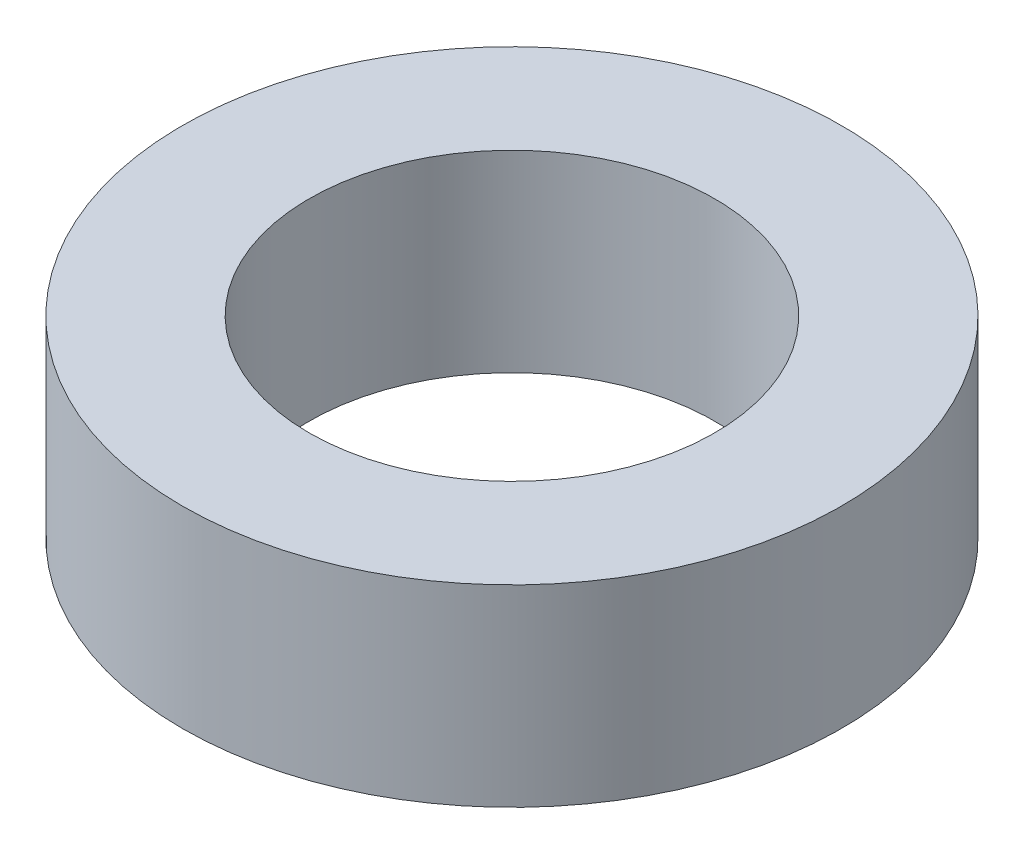
ISO-10303-21;
HEADER;
FILE_DESCRIPTION(('STEP AP214'),'2;1');
FILE_NAME('part.step','',(''),(''),'','','');
FILE_SCHEMA(('AUTOMOTIVE_DESIGN { 1 0 10303 214 1 1 1 1 }'));
ENDSEC;
DATA;
#1=APPLICATION_CONTEXT('core data for automotive mechanical design processes');
#2=APPLICATION_PROTOCOL_DEFINITION('international standard','automotive_design',2000,#1);
#3=PRODUCT_CONTEXT('',#1,'mechanical');
#4=PRODUCT('Part','Part','',(#3));
#5=PRODUCT_RELATED_PRODUCT_CATEGORY('part','',(#4));
#6=PRODUCT_DEFINITION_FORMATION('','',#4);
#7=PRODUCT_DEFINITION_CONTEXT('part definition',#1,'design');
#8=PRODUCT_DEFINITION('design','',#6,#7);
#9=PRODUCT_DEFINITION_SHAPE('','',#8);
#10=(LENGTH_UNIT() NAMED_UNIT(*) SI_UNIT(.MILLI.,.METRE.));
#11=(NAMED_UNIT(*) PLANE_ANGLE_UNIT() SI_UNIT($,.RADIAN.));
#12=(NAMED_UNIT(*) SI_UNIT($,.STERADIAN.) SOLID_ANGLE_UNIT());
#13=UNCERTAINTY_MEASURE_WITH_UNIT(LENGTH_MEASURE(1.E-05),#10,'distance_accuracy_value','');
#14=(GEOMETRIC_REPRESENTATION_CONTEXT(3) GLOBAL_UNCERTAINTY_ASSIGNED_CONTEXT((#13)) GLOBAL_UNIT_ASSIGNED_CONTEXT((#10,
#11,#12)) REPRESENTATION_CONTEXT('',''));
#15=CARTESIAN_POINT('',(0.,0.,0.));
#16=DIRECTION('',(0.,0.,1.));
#17=DIRECTION('',(1.,0.,0.));
#18=AXIS2_PLACEMENT_3D('',#15,#16,#17);
#19=CARTESIAN_POINT('',(0.,19.,0.));
#20=DIRECTION('',(0.,-1.,0.));
#21=DIRECTION('',(0.,0.,-1.));
#22=AXIS2_PLACEMENT_3D('',#19,#20,#21);
#23=CYLINDRICAL_SURFACE('',#22,32.5);
#24=CARTESIAN_POINT('',(0.,19.,0.));
#25=DIRECTION('',(0.,1.,0.));
#26=DIRECTION('',(0.,0.,1.));
#27=AXIS2_PLACEMENT_3D('',#24,#25,#26);
#28=CIRCLE('',#27,32.5);
#29=CARTESIAN_POINT('',(0.,19.,32.5));
#30=VERTEX_POINT('',#29);
#31=EDGE_CURVE('E10',#30,#30,#28,.T.);
#32=ORIENTED_EDGE('',*,*,#31,.F.);
#33=EDGE_LOOP('',(#32));
#34=FACE_BOUND('',#33,.T.);
#35=CARTESIAN_POINT('',(0.,0.,0.));
#36=DIRECTION('',(0.,1.,0.));
#37=DIRECTION('',(0.,0.,1.));
#38=AXIS2_PLACEMENT_3D('',#35,#36,#37);
#39=CIRCLE('',#38,32.5);
#40=CARTESIAN_POINT('',(0.,0.,32.5));
#41=VERTEX_POINT('',#40);
#42=EDGE_CURVE('E37',#41,#41,#39,.T.);
#43=ORIENTED_EDGE('',*,*,#42,.T.);
#44=EDGE_LOOP('',(#43));
#45=FACE_BOUND('',#44,.T.);
#46=ADVANCED_FACE('F40',(#34,#45),#23,.T.);
#47=CARTESIAN_POINT('',(0.,19.,0.));
#48=DIRECTION('',(0.,1.,0.));
#49=DIRECTION('',(0.,0.,1.));
#50=AXIS2_PLACEMENT_3D('',#47,#48,#49);
#51=PLANE('',#50);
#52=CARTESIAN_POINT('',(0.,19.,0.));
#53=DIRECTION('',(0.,1.,0.));
#54=DIRECTION('',(0.,0.,1.));
#55=AXIS2_PLACEMENT_3D('',#52,#53,#54);
#56=CIRCLE('',#55,20.);
#57=CARTESIAN_POINT('',(0.,19.,20.));
#58=VERTEX_POINT('',#57);
#59=EDGE_CURVE('E50',#58,#58,#56,.T.);
#60=ORIENTED_EDGE('',*,*,#59,.F.);
#61=EDGE_LOOP('',(#60));
#62=FACE_BOUND('',#61,.T.);
#63=ORIENTED_EDGE('',*,*,#31,.T.);
#64=EDGE_LOOP('',(#63));
#65=FACE_BOUND('',#64,.T.);
#66=ADVANCED_FACE('F59',(#62,#65),#51,.T.);
#67=CARTESIAN_POINT('',(0.,0.,0.));
#68=DIRECTION('',(0.,1.,0.));
#69=DIRECTION('',(0.,0.,1.));
#70=AXIS2_PLACEMENT_3D('',#67,#68,#69);
#71=PLANE('',#70);
#72=CARTESIAN_POINT('',(0.,0.,0.));
#73=DIRECTION('',(0.,1.,0.));
#74=DIRECTION('',(0.,0.,1.));
#75=AXIS2_PLACEMENT_3D('',#72,#73,#74);
#76=CIRCLE('',#75,20.);
#77=CARTESIAN_POINT('',(0.,0.,20.));
#78=VERTEX_POINT('',#77);
#79=EDGE_CURVE('E47',#78,#78,#76,.T.);
#80=ORIENTED_EDGE('',*,*,#79,.T.);
#81=EDGE_LOOP('',(#80));
#82=FACE_BOUND('',#81,.T.);
#83=ORIENTED_EDGE('',*,*,#42,.F.);
#84=EDGE_LOOP('',(#83));
#85=FACE_BOUND('',#84,.T.);
#86=ADVANCED_FACE('F58',(#82,#85),#71,.F.);
#87=CARTESIAN_POINT('',(0.,19.,0.));
#88=DIRECTION('',(0.,-1.,0.));
#89=DIRECTION('',(0.,0.,-1.));
#90=AXIS2_PLACEMENT_3D('',#87,#88,#89);
#91=CYLINDRICAL_SURFACE('',#90,20.);
#92=ORIENTED_EDGE('',*,*,#59,.T.);
#93=EDGE_LOOP('',(#92));
#94=FACE_BOUND('',#93,.T.);
#95=ORIENTED_EDGE('',*,*,#79,.F.);
#96=EDGE_LOOP('',(#95));
#97=FACE_BOUND('',#96,.T.);
#98=ADVANCED_FACE('F54',(#94,#97),#91,.F.);
#99=CLOSED_SHELL('',(#46,#66,#86,#98));
#100=MANIFOLD_SOLID_BREP('B2',#99);
#101=ADVANCED_BREP_SHAPE_REPRESENTATION('',(#18,#100),#14);
#102=SHAPE_DEFINITION_REPRESENTATION(#9,#101);
ENDSEC;
END-ISO-10303-21;
